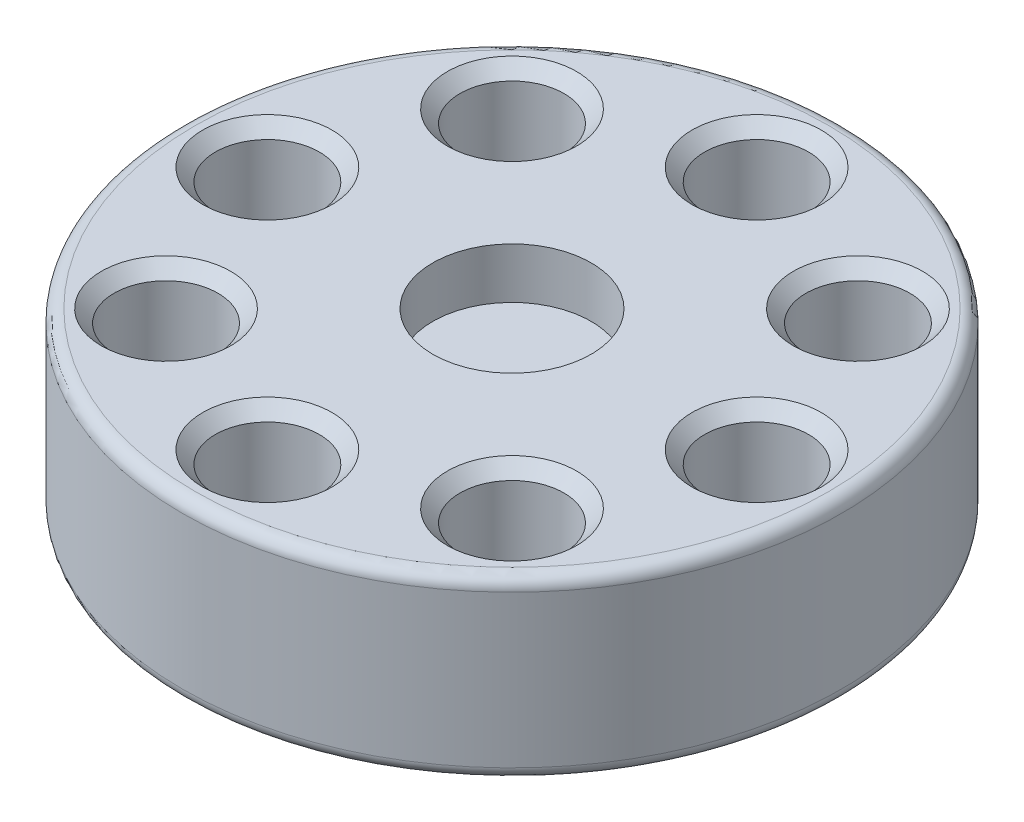
ISO-10303-21;
HEADER;
FILE_DESCRIPTION(('STEP AP214'),'2;1');
FILE_NAME('part.step','',(''),(''),'','','');
FILE_SCHEMA(('AUTOMOTIVE_DESIGN { 1 0 10303 214 1 1 1 1 }'));
ENDSEC;
DATA;
#1=APPLICATION_CONTEXT('core data for automotive mechanical design processes');
#2=APPLICATION_PROTOCOL_DEFINITION('international standard','automotive_design',2000,#1);
#3=PRODUCT_CONTEXT('',#1,'mechanical');
#4=PRODUCT('Part','Part','',(#3));
#5=PRODUCT_RELATED_PRODUCT_CATEGORY('part','',(#4));
#6=PRODUCT_DEFINITION_FORMATION('','',#4);
#7=PRODUCT_DEFINITION_CONTEXT('part definition',#1,'design');
#8=PRODUCT_DEFINITION('design','',#6,#7);
#9=PRODUCT_DEFINITION_SHAPE('','',#8);
#10=(LENGTH_UNIT() NAMED_UNIT(*) SI_UNIT(.MILLI.,.METRE.));
#11=(NAMED_UNIT(*) PLANE_ANGLE_UNIT() SI_UNIT($,.RADIAN.));
#12=(NAMED_UNIT(*) SI_UNIT($,.STERADIAN.) SOLID_ANGLE_UNIT());
#13=UNCERTAINTY_MEASURE_WITH_UNIT(LENGTH_MEASURE(1.E-05),#10,'distance_accuracy_value','');
#14=(GEOMETRIC_REPRESENTATION_CONTEXT(3) GLOBAL_UNCERTAINTY_ASSIGNED_CONTEXT((#13)) GLOBAL_UNIT_ASSIGNED_CONTEXT((#10,
#11,#12)) REPRESENTATION_CONTEXT('',''));
#15=CARTESIAN_POINT('',(0.,0.,0.));
#16=DIRECTION('',(0.,0.,1.));
#17=DIRECTION('',(1.,0.,0.));
#18=AXIS2_PLACEMENT_3D('',#15,#16,#17);
#19=CARTESIAN_POINT('',(0.,14.,0.));
#20=DIRECTION('',(0.,-1.,0.));
#21=DIRECTION('',(0.,0.,-1.));
#22=AXIS2_PLACEMENT_3D('',#19,#20,#21);
#23=CYLINDRICAL_SURFACE('',#22,26.);
#24=CARTESIAN_POINT('',(0.,0.999999999999999,0.));
#25=DIRECTION('',(0.,1.,0.));
#26=DIRECTION('',(0.,0.,1.));
#27=AXIS2_PLACEMENT_3D('',#24,#25,#26);
#28=CIRCLE('',#27,26.);
#29=CARTESIAN_POINT('',(0.,0.999999999999999,26.));
#30=VERTEX_POINT('',#29);
#31=EDGE_CURVE('E186',#30,#30,#28,.T.);
#32=ORIENTED_EDGE('',*,*,#31,.T.);
#33=EDGE_LOOP('',(#32));
#34=FACE_BOUND('',#33,.T.);
#35=CARTESIAN_POINT('',(0.,13.,0.));
#36=DIRECTION('',(0.,1.,0.));
#37=DIRECTION('',(0.,0.,1.));
#38=AXIS2_PLACEMENT_3D('',#35,#36,#37);
#39=CIRCLE('',#38,26.);
#40=CARTESIAN_POINT('',(0.,13.,26.));
#41=VERTEX_POINT('',#40);
#42=EDGE_CURVE('E190',#41,#41,#39,.F.);
#43=ORIENTED_EDGE('',*,*,#42,.T.);
#44=EDGE_LOOP('',(#43));
#45=FACE_BOUND('',#44,.T.);
#46=ADVANCED_FACE('F41',(#34,#45),#23,.T.);
#47=CARTESIAN_POINT('',(0.,14.,0.));
#48=DIRECTION('',(0.,1.,0.));
#49=DIRECTION('',(0.,0.,1.));
#50=AXIS2_PLACEMENT_3D('',#47,#48,#49);
#51=PLANE('',#50);
#52=CARTESIAN_POINT('',(13.6471608769004,14.,13.6471608769004));
#53=DIRECTION('',(0.,1.,0.));
#54=DIRECTION('',(0.,0.,1.));
#55=AXIS2_PLACEMENT_3D('',#52,#53,#54);
#56=CIRCLE('',#55,5.1);
#57=CARTESIAN_POINT('',(13.6471608769004,14.,18.7471608769004));
#58=VERTEX_POINT('',#57);
#59=EDGE_CURVE('E138',#58,#58,#56,.F.);
#60=ORIENTED_EDGE('',*,*,#59,.T.);
#61=EDGE_LOOP('',(#60));
#62=FACE_BOUND('',#61,.T.);
#63=CARTESIAN_POINT('',(0.,14.,19.3));
#64=DIRECTION('',(0.,1.,0.));
#65=DIRECTION('',(0.,0.,1.));
#66=AXIS2_PLACEMENT_3D('',#63,#64,#65);
#67=CIRCLE('',#66,5.1);
#68=CARTESIAN_POINT('',(0.,14.,24.4));
#69=VERTEX_POINT('',#68);
#70=EDGE_CURVE('E142',#69,#69,#67,.F.);
#71=ORIENTED_EDGE('',*,*,#70,.T.);
#72=EDGE_LOOP('',(#71));
#73=FACE_BOUND('',#72,.T.);
#74=CARTESIAN_POINT('',(-13.6471608769004,14.,13.6471608769004));
#75=DIRECTION('',(0.,1.,0.));
#76=DIRECTION('',(0.,0.,1.));
#77=AXIS2_PLACEMENT_3D('',#74,#75,#76);
#78=CIRCLE('',#77,5.1);
#79=CARTESIAN_POINT('',(-13.6471608769004,14.,18.7471608769004));
#80=VERTEX_POINT('',#79);
#81=EDGE_CURVE('E146',#80,#80,#78,.F.);
#82=ORIENTED_EDGE('',*,*,#81,.T.);
#83=EDGE_LOOP('',(#82));
#84=FACE_BOUND('',#83,.T.);
#85=CARTESIAN_POINT('',(0.,14.,-19.3));
#86=DIRECTION('',(0.,1.,0.));
#87=DIRECTION('',(0.,0.,1.));
#88=AXIS2_PLACEMENT_3D('',#85,#86,#87);
#89=CIRCLE('',#88,5.10000000000002);
#90=CARTESIAN_POINT('',(0.,14.,-14.2));
#91=VERTEX_POINT('',#90);
#92=EDGE_CURVE('E150',#91,#91,#89,.F.);
#93=ORIENTED_EDGE('',*,*,#92,.T.);
#94=EDGE_LOOP('',(#93));
#95=FACE_BOUND('',#94,.T.);
#96=CARTESIAN_POINT('',(-19.3,14.,0.));
#97=DIRECTION('',(0.,1.,0.));
#98=DIRECTION('',(0.,0.,1.));
#99=AXIS2_PLACEMENT_3D('',#96,#97,#98);
#100=CIRCLE('',#99,5.1);
#101=CARTESIAN_POINT('',(-19.3,14.,5.1));
#102=VERTEX_POINT('',#101);
#103=EDGE_CURVE('E154',#102,#102,#100,.F.);
#104=ORIENTED_EDGE('',*,*,#103,.T.);
#105=EDGE_LOOP('',(#104));
#106=FACE_BOUND('',#105,.T.);
#107=CARTESIAN_POINT('',(-13.6471608769,14.,-13.6471608769002));
#108=DIRECTION('',(0.,1.,0.));
#109=DIRECTION('',(0.,0.,1.));
#110=AXIS2_PLACEMENT_3D('',#107,#108,#109);
#111=CIRCLE('',#110,5.1);
#112=CARTESIAN_POINT('',(-13.6471608769,14.,-8.54716087690015));
#113=VERTEX_POINT('',#112);
#114=EDGE_CURVE('E158',#113,#113,#111,.F.);
#115=ORIENTED_EDGE('',*,*,#114,.T.);
#116=EDGE_LOOP('',(#115));
#117=FACE_BOUND('',#116,.T.);
#118=CARTESIAN_POINT('',(13.6471608769005,14.,-13.6471608769007));
#119=DIRECTION('',(0.,1.,0.));
#120=DIRECTION('',(0.,0.,1.));
#121=AXIS2_PLACEMENT_3D('',#118,#119,#120);
#122=CIRCLE('',#121,5.10000000000002);
#123=CARTESIAN_POINT('',(13.6471608769005,14.,-8.54716087690071));
#124=VERTEX_POINT('',#123);
#125=EDGE_CURVE('E162',#124,#124,#122,.F.);
#126=ORIENTED_EDGE('',*,*,#125,.T.);
#127=EDGE_LOOP('',(#126));
#128=FACE_BOUND('',#127,.T.);
#129=CARTESIAN_POINT('',(19.3,14.,0.));
#130=DIRECTION('',(0.,1.,0.));
#131=DIRECTION('',(0.,0.,1.));
#132=AXIS2_PLACEMENT_3D('',#129,#130,#131);
#133=CIRCLE('',#132,5.1);
#134=CARTESIAN_POINT('',(19.3,14.,5.1));
#135=VERTEX_POINT('',#134);
#136=EDGE_CURVE('E166',#135,#135,#133,.F.);
#137=ORIENTED_EDGE('',*,*,#136,.T.);
#138=EDGE_LOOP('',(#137));
#139=FACE_BOUND('',#138,.T.);
#140=CARTESIAN_POINT('',(0.,14.,0.));
#141=DIRECTION('',(0.,1.,0.));
#142=DIRECTION('',(0.,0.,1.));
#143=AXIS2_PLACEMENT_3D('',#140,#141,#142);
#144=CIRCLE('',#143,25.);
#145=CARTESIAN_POINT('',(0.,14.,25.));
#146=VERTEX_POINT('',#145);
#147=EDGE_CURVE('E178',#146,#146,#144,.T.);
#148=ORIENTED_EDGE('',*,*,#147,.T.);
#149=EDGE_LOOP('',(#148));
#150=FACE_BOUND('',#149,.T.);
#151=CARTESIAN_POINT('',(0.,14.,0.));
#152=DIRECTION('',(0.,1.,0.));
#153=DIRECTION('',(0.,0.,1.));
#154=AXIS2_PLACEMENT_3D('',#151,#152,#153);
#155=CIRCLE('',#154,6.25);
#156=CARTESIAN_POINT('',(0.,14.,6.25));
#157=VERTEX_POINT('',#156);
#158=EDGE_CURVE('E203',#157,#157,#155,.T.);
#159=ORIENTED_EDGE('',*,*,#158,.F.);
#160=EDGE_LOOP('',(#159));
#161=FACE_BOUND('',#160,.T.);
#162=ADVANCED_FACE('F220',(#62,#73,#84,#95,#106,#117,#128,#139,#150,#161),#51,.T.);
#163=CARTESIAN_POINT('',(0.,0.,0.));
#164=DIRECTION('',(0.,1.,0.));
#165=DIRECTION('',(0.,0.,1.));
#166=AXIS2_PLACEMENT_3D('',#163,#164,#165);
#167=PLANE('',#166);
#168=CARTESIAN_POINT('',(13.6471608769004,0.,13.6471608769004));
#169=DIRECTION('',(0.,1.,0.));
#170=DIRECTION('',(0.,0.,1.));
#171=AXIS2_PLACEMENT_3D('',#168,#169,#170);
#172=CIRCLE('',#171,5.1);
#173=CARTESIAN_POINT('',(13.6471608769004,0.,18.7471608769004));
#174=VERTEX_POINT('',#173);
#175=EDGE_CURVE('E106',#174,#174,#172,.T.);
#176=ORIENTED_EDGE('',*,*,#175,.T.);
#177=EDGE_LOOP('',(#176));
#178=FACE_BOUND('',#177,.T.);
#179=CARTESIAN_POINT('',(0.,0.,19.3));
#180=DIRECTION('',(0.,1.,0.));
#181=DIRECTION('',(0.,0.,1.));
#182=AXIS2_PLACEMENT_3D('',#179,#180,#181);
#183=CIRCLE('',#182,5.09999999999999);
#184=CARTESIAN_POINT('',(0.,0.,24.4));
#185=VERTEX_POINT('',#184);
#186=EDGE_CURVE('E110',#185,#185,#183,.T.);
#187=ORIENTED_EDGE('',*,*,#186,.T.);
#188=EDGE_LOOP('',(#187));
#189=FACE_BOUND('',#188,.T.);
#190=CARTESIAN_POINT('',(-13.6471608769004,0.,13.6471608769004));
#191=DIRECTION('',(0.,1.,0.));
#192=DIRECTION('',(0.,0.,1.));
#193=AXIS2_PLACEMENT_3D('',#190,#191,#192);
#194=CIRCLE('',#193,5.09999999999999);
#195=CARTESIAN_POINT('',(-13.6471608769004,0.,18.7471608769004));
#196=VERTEX_POINT('',#195);
#197=EDGE_CURVE('E114',#196,#196,#194,.T.);
#198=ORIENTED_EDGE('',*,*,#197,.T.);
#199=EDGE_LOOP('',(#198));
#200=FACE_BOUND('',#199,.T.);
#201=CARTESIAN_POINT('',(0.,0.,-19.3));
#202=DIRECTION('',(0.,1.,0.));
#203=DIRECTION('',(0.,0.,1.));
#204=AXIS2_PLACEMENT_3D('',#201,#202,#203);
#205=CIRCLE('',#204,5.09999999999999);
#206=CARTESIAN_POINT('',(0.,0.,-14.2));
#207=VERTEX_POINT('',#206);
#208=EDGE_CURVE('E118',#207,#207,#205,.T.);
#209=ORIENTED_EDGE('',*,*,#208,.T.);
#210=EDGE_LOOP('',(#209));
#211=FACE_BOUND('',#210,.T.);
#212=CARTESIAN_POINT('',(-19.3,0.,0.));
#213=DIRECTION('',(0.,1.,0.));
#214=DIRECTION('',(0.,0.,1.));
#215=AXIS2_PLACEMENT_3D('',#212,#213,#214);
#216=CIRCLE('',#215,5.09999999999999);
#217=CARTESIAN_POINT('',(-19.3,0.,5.09999999999999));
#218=VERTEX_POINT('',#217);
#219=EDGE_CURVE('E122',#218,#218,#216,.T.);
#220=ORIENTED_EDGE('',*,*,#219,.T.);
#221=EDGE_LOOP('',(#220));
#222=FACE_BOUND('',#221,.T.);
#223=CARTESIAN_POINT('',(-13.6471608769,0.,-13.6471608769002));
#224=DIRECTION('',(0.,1.,0.));
#225=DIRECTION('',(0.,0.,1.));
#226=AXIS2_PLACEMENT_3D('',#223,#224,#225);
#227=CIRCLE('',#226,5.09999999999999);
#228=CARTESIAN_POINT('',(-13.6471608769,0.,-8.54716087690016));
#229=VERTEX_POINT('',#228);
#230=EDGE_CURVE('E126',#229,#229,#227,.T.);
#231=ORIENTED_EDGE('',*,*,#230,.T.);
#232=EDGE_LOOP('',(#231));
#233=FACE_BOUND('',#232,.T.);
#234=CARTESIAN_POINT('',(13.6471608769005,0.,-13.6471608769007));
#235=DIRECTION('',(0.,1.,0.));
#236=DIRECTION('',(0.,0.,1.));
#237=AXIS2_PLACEMENT_3D('',#234,#235,#236);
#238=CIRCLE('',#237,5.09999999999999);
#239=CARTESIAN_POINT('',(13.6471608769005,0.,-8.54716087690074));
#240=VERTEX_POINT('',#239);
#241=EDGE_CURVE('E130',#240,#240,#238,.T.);
#242=ORIENTED_EDGE('',*,*,#241,.T.);
#243=EDGE_LOOP('',(#242));
#244=FACE_BOUND('',#243,.T.);
#245=CARTESIAN_POINT('',(19.3,0.,0.));
#246=DIRECTION('',(0.,1.,0.));
#247=DIRECTION('',(0.,0.,1.));
#248=AXIS2_PLACEMENT_3D('',#245,#246,#247);
#249=CIRCLE('',#248,5.09999999999999);
#250=CARTESIAN_POINT('',(19.3,0.,5.1));
#251=VERTEX_POINT('',#250);
#252=EDGE_CURVE('E134',#251,#251,#249,.T.);
#253=ORIENTED_EDGE('',*,*,#252,.T.);
#254=EDGE_LOOP('',(#253));
#255=FACE_BOUND('',#254,.T.);
#256=CARTESIAN_POINT('',(0.,0.,0.));
#257=DIRECTION('',(0.,1.,0.));
#258=DIRECTION('',(0.,0.,1.));
#259=AXIS2_PLACEMENT_3D('',#256,#257,#258);
#260=CIRCLE('',#259,25.);
#261=CARTESIAN_POINT('',(0.,0.,25.));
#262=VERTEX_POINT('',#261);
#263=EDGE_CURVE('E182',#262,#262,#260,.F.);
#264=ORIENTED_EDGE('',*,*,#263,.T.);
#265=EDGE_LOOP('',(#264));
#266=FACE_BOUND('',#265,.T.);
#267=CARTESIAN_POINT('',(0.,0.,0.));
#268=DIRECTION('',(0.,-1.,0.));
#269=DIRECTION('',(0.,0.,-1.));
#270=AXIS2_PLACEMENT_3D('',#267,#268,#269);
#271=CIRCLE('',#270,6.1);
#272=CARTESIAN_POINT('',(0.,0.,-6.1));
#273=VERTEX_POINT('',#272);
#274=EDGE_CURVE('E195',#273,#273,#271,.T.);
#275=ORIENTED_EDGE('',*,*,#274,.F.);
#276=EDGE_LOOP('',(#275));
#277=FACE_BOUND('',#276,.T.);
#278=ADVANCED_FACE('F222',(#178,#189,#200,#211,#222,#233,#244,#255,#266,#277),#167,.F.);
#279=CARTESIAN_POINT('',(0.,4.,0.));
#280=DIRECTION('',(0.,-1.,0.));
#281=DIRECTION('',(0.,0.,-1.));
#282=AXIS2_PLACEMENT_3D('',#279,#280,#281);
#283=CYLINDRICAL_SURFACE('',#282,6.1);
#284=CARTESIAN_POINT('',(0.,4.,0.));
#285=DIRECTION('',(0.,-1.,0.));
#286=DIRECTION('',(0.,0.,-1.));
#287=AXIS2_PLACEMENT_3D('',#284,#285,#286);
#288=CIRCLE('',#287,6.1);
#289=CARTESIAN_POINT('',(0.,4.,-6.1));
#290=VERTEX_POINT('',#289);
#291=EDGE_CURVE('E194',#290,#290,#288,.T.);
#292=ORIENTED_EDGE('',*,*,#291,.F.);
#293=EDGE_LOOP('',(#292));
#294=FACE_BOUND('',#293,.T.);
#295=ORIENTED_EDGE('',*,*,#274,.T.);
#296=EDGE_LOOP('',(#295));
#297=FACE_BOUND('',#296,.T.);
#298=ADVANCED_FACE('F229',(#294,#297),#283,.F.);
#299=CARTESIAN_POINT('',(0.,4.,0.));
#300=DIRECTION('',(0.,-1.,0.));
#301=DIRECTION('',(0.,0.,-1.));
#302=AXIS2_PLACEMENT_3D('',#299,#300,#301);
#303=PLANE('',#302);
#304=ORIENTED_EDGE('',*,*,#291,.T.);
#305=EDGE_LOOP('',(#304));
#306=FACE_BOUND('',#305,.T.);
#307=ADVANCED_FACE('F216',(#306),#303,.T.);
#308=CARTESIAN_POINT('',(0.,10.,0.));
#309=DIRECTION('',(0.,1.,0.));
#310=DIRECTION('',(0.,0.,1.));
#311=AXIS2_PLACEMENT_3D('',#308,#309,#310);
#312=CYLINDRICAL_SURFACE('',#311,6.25);
#313=CARTESIAN_POINT('',(0.,10.,0.));
#314=DIRECTION('',(0.,1.,0.));
#315=DIRECTION('',(0.,0.,1.));
#316=AXIS2_PLACEMENT_3D('',#313,#314,#315);
#317=CIRCLE('',#316,6.25);
#318=CARTESIAN_POINT('',(0.,10.,6.25));
#319=VERTEX_POINT('',#318);
#320=EDGE_CURVE('E199',#319,#319,#317,.T.);
#321=ORIENTED_EDGE('',*,*,#320,.F.);
#322=EDGE_LOOP('',(#321));
#323=FACE_BOUND('',#322,.T.);
#324=ORIENTED_EDGE('',*,*,#158,.T.);
#325=EDGE_LOOP('',(#324));
#326=FACE_BOUND('',#325,.T.);
#327=ADVANCED_FACE('F213',(#323,#326),#312,.F.);
#328=CARTESIAN_POINT('',(0.,10.,0.));
#329=DIRECTION('',(0.,1.,0.));
#330=DIRECTION('',(0.,0.,1.));
#331=AXIS2_PLACEMENT_3D('',#328,#329,#330);
#332=PLANE('',#331);
#333=ORIENTED_EDGE('',*,*,#320,.T.);
#334=EDGE_LOOP('',(#333));
#335=FACE_BOUND('',#334,.T.);
#336=ADVANCED_FACE('F211',(#335),#332,.T.);
#337=CARTESIAN_POINT('',(0.,8.,19.3));
#338=DIRECTION('',(0.,-1.,0.));
#339=DIRECTION('',(0.,0.,-1.));
#340=AXIS2_PLACEMENT_3D('',#337,#338,#339);
#341=CYLINDRICAL_SURFACE('',#340,4.1);
#342=CARTESIAN_POINT('',(0.,13.,19.3));
#343=DIRECTION('',(0.,1.,0.));
#344=DIRECTION('',(0.,0.,1.));
#345=AXIS2_PLACEMENT_3D('',#342,#343,#344);
#346=CIRCLE('',#345,4.1);
#347=CARTESIAN_POINT('',(0.,13.,23.4));
#348=VERTEX_POINT('',#347);
#349=EDGE_CURVE('E98',#348,#348,#346,.T.);
#350=ORIENTED_EDGE('',*,*,#349,.T.);
#351=EDGE_LOOP('',(#350));
#352=FACE_BOUND('',#351,.T.);
#353=CARTESIAN_POINT('',(0.,0.999999999999999,19.3));
#354=DIRECTION('',(0.,1.,0.));
#355=DIRECTION('',(0.,0.,1.));
#356=AXIS2_PLACEMENT_3D('',#353,#354,#355);
#357=CIRCLE('',#356,4.1);
#358=CARTESIAN_POINT('',(0.,0.999999999999999,23.4));
#359=VERTEX_POINT('',#358);
#360=EDGE_CURVE('E102',#359,#359,#357,.F.);
#361=ORIENTED_EDGE('',*,*,#360,.T.);
#362=EDGE_LOOP('',(#361));
#363=FACE_BOUND('',#362,.T.);
#364=ADVANCED_FACE('F377',(#352,#363),#341,.F.);
#365=CARTESIAN_POINT('',(13.6471608769004,8.,13.6471608769004));
#366=DIRECTION('',(0.,-1.,0.));
#367=DIRECTION('',(0.,0.,-1.));
#368=AXIS2_PLACEMENT_3D('',#365,#366,#367);
#369=CYLINDRICAL_SURFACE('',#368,4.1);
#370=CARTESIAN_POINT('',(13.6471608769004,13.,13.6471608769004));
#371=DIRECTION('',(0.,1.,0.));
#372=DIRECTION('',(0.,0.,1.));
#373=AXIS2_PLACEMENT_3D('',#370,#371,#372);
#374=CIRCLE('',#373,4.1);
#375=CARTESIAN_POINT('',(13.6471608769004,13.,17.7471608769004));
#376=VERTEX_POINT('',#375);
#377=EDGE_CURVE('E170',#376,#376,#374,.T.);
#378=ORIENTED_EDGE('',*,*,#377,.T.);
#379=EDGE_LOOP('',(#378));
#380=FACE_BOUND('',#379,.T.);
#381=CARTESIAN_POINT('',(13.6471608769004,0.999999999999999,13.6471608769004));
#382=DIRECTION('',(0.,1.,0.));
#383=DIRECTION('',(0.,0.,1.));
#384=AXIS2_PLACEMENT_3D('',#381,#382,#383);
#385=CIRCLE('',#384,4.1);
#386=CARTESIAN_POINT('',(13.6471608769004,0.999999999999999,17.7471608769004));
#387=VERTEX_POINT('',#386);
#388=EDGE_CURVE('E174',#387,#387,#385,.F.);
#389=ORIENTED_EDGE('',*,*,#388,.T.);
#390=EDGE_LOOP('',(#389));
#391=FACE_BOUND('',#390,.T.);
#392=ADVANCED_FACE('F380',(#380,#391),#369,.F.);
#393=CARTESIAN_POINT('',(19.3,8.,0.));
#394=DIRECTION('',(0.,-1.,0.));
#395=DIRECTION('',(0.,0.,-1.));
#396=AXIS2_PLACEMENT_3D('',#393,#394,#395);
#397=CYLINDRICAL_SURFACE('',#396,4.1);
#398=CARTESIAN_POINT('',(19.3,13.,0.));
#399=DIRECTION('',(0.,1.,0.));
#400=DIRECTION('',(0.,0.,1.));
#401=AXIS2_PLACEMENT_3D('',#398,#399,#400);
#402=CIRCLE('',#401,4.1);
#403=CARTESIAN_POINT('',(19.3,13.,4.1));
#404=VERTEX_POINT('',#403);
#405=EDGE_CURVE('E10',#404,#404,#402,.T.);
#406=ORIENTED_EDGE('',*,*,#405,.T.);
#407=EDGE_LOOP('',(#406));
#408=FACE_BOUND('',#407,.T.);
#409=CARTESIAN_POINT('',(19.3,0.999999999999999,0.));
#410=DIRECTION('',(0.,1.,0.));
#411=DIRECTION('',(0.,0.,1.));
#412=AXIS2_PLACEMENT_3D('',#409,#410,#411);
#413=CIRCLE('',#412,4.1);
#414=CARTESIAN_POINT('',(19.3,0.999999999999999,4.1));
#415=VERTEX_POINT('',#414);
#416=EDGE_CURVE('E50',#415,#415,#413,.F.);
#417=ORIENTED_EDGE('',*,*,#416,.T.);
#418=EDGE_LOOP('',(#417));
#419=FACE_BOUND('',#418,.T.);
#420=ADVANCED_FACE('F400',(#408,#419),#397,.F.);
#421=CARTESIAN_POINT('',(13.6471608769005,8.,-13.6471608769007));
#422=DIRECTION('',(0.,-1.,0.));
#423=DIRECTION('',(0.,0.,-1.));
#424=AXIS2_PLACEMENT_3D('',#421,#422,#423);
#425=CYLINDRICAL_SURFACE('',#424,4.1);
#426=CARTESIAN_POINT('',(13.6471608769005,13.,-13.6471608769007));
#427=DIRECTION('',(0.,1.,0.));
#428=DIRECTION('',(0.,0.,1.));
#429=AXIS2_PLACEMENT_3D('',#426,#427,#428);
#430=CIRCLE('',#429,4.1);
#431=CARTESIAN_POINT('',(13.6471608769005,13.,-9.54716087690073));
#432=VERTEX_POINT('',#431);
#433=EDGE_CURVE('E55',#432,#432,#430,.T.);
#434=ORIENTED_EDGE('',*,*,#433,.T.);
#435=EDGE_LOOP('',(#434));
#436=FACE_BOUND('',#435,.T.);
#437=CARTESIAN_POINT('',(13.6471608769005,0.999999999999999,-13.6471608769007));
#438=DIRECTION('',(0.,1.,0.));
#439=DIRECTION('',(0.,0.,1.));
#440=AXIS2_PLACEMENT_3D('',#437,#438,#439);
#441=CIRCLE('',#440,4.1);
#442=CARTESIAN_POINT('',(13.6471608769005,0.999999999999999,-9.54716087690073));
#443=VERTEX_POINT('',#442);
#444=EDGE_CURVE('E60',#443,#443,#441,.F.);
#445=ORIENTED_EDGE('',*,*,#444,.T.);
#446=EDGE_LOOP('',(#445));
#447=FACE_BOUND('',#446,.T.);
#448=ADVANCED_FACE('F396',(#436,#447),#425,.F.);
#449=CARTESIAN_POINT('',(0.,8.,-19.3));
#450=DIRECTION('',(0.,-1.,0.));
#451=DIRECTION('',(0.,0.,-1.));
#452=AXIS2_PLACEMENT_3D('',#449,#450,#451);
#453=CYLINDRICAL_SURFACE('',#452,4.1);
#454=CARTESIAN_POINT('',(0.,13.,-19.3));
#455=DIRECTION('',(0.,1.,0.));
#456=DIRECTION('',(0.,0.,1.));
#457=AXIS2_PLACEMENT_3D('',#454,#455,#456);
#458=CIRCLE('',#457,4.1);
#459=CARTESIAN_POINT('',(0.,13.,-15.2));
#460=VERTEX_POINT('',#459);
#461=EDGE_CURVE('E82',#460,#460,#458,.T.);
#462=ORIENTED_EDGE('',*,*,#461,.T.);
#463=EDGE_LOOP('',(#462));
#464=FACE_BOUND('',#463,.T.);
#465=CARTESIAN_POINT('',(0.,0.999999999999999,-19.3));
#466=DIRECTION('',(0.,1.,0.));
#467=DIRECTION('',(0.,0.,1.));
#468=AXIS2_PLACEMENT_3D('',#465,#466,#467);
#469=CIRCLE('',#468,4.1);
#470=CARTESIAN_POINT('',(0.,0.999999999999999,-15.2));
#471=VERTEX_POINT('',#470);
#472=EDGE_CURVE('E86',#471,#471,#469,.F.);
#473=ORIENTED_EDGE('',*,*,#472,.T.);
#474=EDGE_LOOP('',(#473));
#475=FACE_BOUND('',#474,.T.);
#476=ADVANCED_FACE('F392',(#464,#475),#453,.F.);
#477=CARTESIAN_POINT('',(-13.6471608769,8.,-13.6471608769002));
#478=DIRECTION('',(0.,-1.,0.));
#479=DIRECTION('',(0.,0.,-1.));
#480=AXIS2_PLACEMENT_3D('',#477,#478,#479);
#481=CYLINDRICAL_SURFACE('',#480,4.1);
#482=CARTESIAN_POINT('',(-13.6471608769,13.,-13.6471608769002));
#483=DIRECTION('',(0.,1.,0.));
#484=DIRECTION('',(0.,0.,1.));
#485=AXIS2_PLACEMENT_3D('',#482,#483,#484);
#486=CIRCLE('',#485,4.1);
#487=CARTESIAN_POINT('',(-13.6471608769,13.,-9.54716087690015));
#488=VERTEX_POINT('',#487);
#489=EDGE_CURVE('E66',#488,#488,#486,.T.);
#490=ORIENTED_EDGE('',*,*,#489,.T.);
#491=EDGE_LOOP('',(#490));
#492=FACE_BOUND('',#491,.T.);
#493=CARTESIAN_POINT('',(-13.6471608769,0.999999999999999,-13.6471608769002));
#494=DIRECTION('',(0.,1.,0.));
#495=DIRECTION('',(0.,0.,1.));
#496=AXIS2_PLACEMENT_3D('',#493,#494,#495);
#497=CIRCLE('',#496,4.1);
#498=CARTESIAN_POINT('',(-13.6471608769,0.999999999999999,-9.54716087690015));
#499=VERTEX_POINT('',#498);
#500=EDGE_CURVE('E70',#499,#499,#497,.F.);
#501=ORIENTED_EDGE('',*,*,#500,.T.);
#502=EDGE_LOOP('',(#501));
#503=FACE_BOUND('',#502,.T.);
#504=ADVANCED_FACE('F388',(#492,#503),#481,.F.);
#505=CARTESIAN_POINT('',(-19.3,8.,0.));
#506=DIRECTION('',(0.,-1.,0.));
#507=DIRECTION('',(0.,0.,-1.));
#508=AXIS2_PLACEMENT_3D('',#505,#506,#507);
#509=CYLINDRICAL_SURFACE('',#508,4.1);
#510=CARTESIAN_POINT('',(-19.3,13.,0.));
#511=DIRECTION('',(0.,1.,0.));
#512=DIRECTION('',(0.,0.,1.));
#513=AXIS2_PLACEMENT_3D('',#510,#511,#512);
#514=CIRCLE('',#513,4.1);
#515=CARTESIAN_POINT('',(-19.3,13.,4.1));
#516=VERTEX_POINT('',#515);
#517=EDGE_CURVE('E74',#516,#516,#514,.T.);
#518=ORIENTED_EDGE('',*,*,#517,.T.);
#519=EDGE_LOOP('',(#518));
#520=FACE_BOUND('',#519,.T.);
#521=CARTESIAN_POINT('',(-19.3,0.999999999999999,0.));
#522=DIRECTION('',(0.,1.,0.));
#523=DIRECTION('',(0.,0.,1.));
#524=AXIS2_PLACEMENT_3D('',#521,#522,#523);
#525=CIRCLE('',#524,4.1);
#526=CARTESIAN_POINT('',(-19.3,0.999999999999999,4.1));
#527=VERTEX_POINT('',#526);
#528=EDGE_CURVE('E78',#527,#527,#525,.F.);
#529=ORIENTED_EDGE('',*,*,#528,.T.);
#530=EDGE_LOOP('',(#529));
#531=FACE_BOUND('',#530,.T.);
#532=ADVANCED_FACE('F384',(#520,#531),#509,.F.);
#533=CARTESIAN_POINT('',(-13.6471608769004,8.,13.6471608769004));
#534=DIRECTION('',(0.,-1.,0.));
#535=DIRECTION('',(0.,0.,-1.));
#536=AXIS2_PLACEMENT_3D('',#533,#534,#535);
#537=CYLINDRICAL_SURFACE('',#536,4.1);
#538=CARTESIAN_POINT('',(-13.6471608769004,13.,13.6471608769004));
#539=DIRECTION('',(0.,1.,0.));
#540=DIRECTION('',(0.,0.,1.));
#541=AXIS2_PLACEMENT_3D('',#538,#539,#540);
#542=CIRCLE('',#541,4.1);
#543=CARTESIAN_POINT('',(-13.6471608769004,13.,17.7471608769004));
#544=VERTEX_POINT('',#543);
#545=EDGE_CURVE('E90',#544,#544,#542,.T.);
#546=ORIENTED_EDGE('',*,*,#545,.T.);
#547=EDGE_LOOP('',(#546));
#548=FACE_BOUND('',#547,.T.);
#549=CARTESIAN_POINT('',(-13.6471608769004,0.999999999999999,13.6471608769004));
#550=DIRECTION('',(0.,1.,0.));
#551=DIRECTION('',(0.,0.,1.));
#552=AXIS2_PLACEMENT_3D('',#549,#550,#551);
#553=CIRCLE('',#552,4.1);
#554=CARTESIAN_POINT('',(-13.6471608769004,0.999999999999999,17.7471608769004));
#555=VERTEX_POINT('',#554);
#556=EDGE_CURVE('E94',#555,#555,#553,.F.);
#557=ORIENTED_EDGE('',*,*,#556,.T.);
#558=EDGE_LOOP('',(#557));
#559=FACE_BOUND('',#558,.T.);
#560=ADVANCED_FACE('F242',(#548,#559),#537,.F.);
#561=CARTESIAN_POINT('',(0.,0.999999999999999,0.));
#562=DIRECTION('',(0.,1.,0.));
#563=DIRECTION('',(0.,0.,1.));
#564=AXIS2_PLACEMENT_3D('',#561,#562,#563);
#565=TOROIDAL_SURFACE('',#564,25.,1.);
#566=ORIENTED_EDGE('',*,*,#263,.F.);
#567=EDGE_LOOP('',(#566));
#568=FACE_BOUND('',#567,.T.);
#569=ORIENTED_EDGE('',*,*,#31,.F.);
#570=EDGE_LOOP('',(#569));
#571=FACE_BOUND('',#570,.T.);
#572=ADVANCED_FACE('F238',(#568,#571),#565,.T.);
#573=CARTESIAN_POINT('',(0.,13.,0.));
#574=DIRECTION('',(0.,1.,0.));
#575=DIRECTION('',(0.,0.,1.));
#576=AXIS2_PLACEMENT_3D('',#573,#574,#575);
#577=TOROIDAL_SURFACE('',#576,25.,1.);
#578=ORIENTED_EDGE('',*,*,#42,.F.);
#579=EDGE_LOOP('',(#578));
#580=FACE_BOUND('',#579,.T.);
#581=ORIENTED_EDGE('',*,*,#147,.F.);
#582=EDGE_LOOP('',(#581));
#583=FACE_BOUND('',#582,.T.);
#584=ADVANCED_FACE('F241',(#580,#583),#577,.T.);
#585=CARTESIAN_POINT('',(13.6471608769004,13.,13.6471608769004));
#586=DIRECTION('',(0.,1.,0.));
#587=DIRECTION('',(0.,0.,1.));
#588=AXIS2_PLACEMENT_3D('',#585,#586,#587);
#589=CONICAL_SURFACE('',#588,4.1,0.785398163397452);
#590=ORIENTED_EDGE('',*,*,#59,.F.);
#591=EDGE_LOOP('',(#590));
#592=FACE_BOUND('',#591,.T.);
#593=ORIENTED_EDGE('',*,*,#377,.F.);
#594=EDGE_LOOP('',(#593));
#595=FACE_BOUND('',#594,.T.);
#596=ADVANCED_FACE('F246',(#592,#595),#589,.F.);
#597=CARTESIAN_POINT('',(13.6471608769004,0.,13.6471608769004));
#598=DIRECTION('',(0.,-1.,0.));
#599=DIRECTION('',(0.,0.,-1.));
#600=AXIS2_PLACEMENT_3D('',#597,#598,#599);
#601=CONICAL_SURFACE('',#600,5.1,0.785398163397446);
#602=ORIENTED_EDGE('',*,*,#388,.F.);
#603=EDGE_LOOP('',(#602));
#604=FACE_BOUND('',#603,.T.);
#605=ORIENTED_EDGE('',*,*,#175,.F.);
#606=EDGE_LOOP('',(#605));
#607=FACE_BOUND('',#606,.T.);
#608=ADVANCED_FACE('F254',(#604,#607),#601,.F.);
#609=CARTESIAN_POINT('',(0.,13.,19.3));
#610=DIRECTION('',(0.,1.,0.));
#611=DIRECTION('',(0.,0.,1.));
#612=AXIS2_PLACEMENT_3D('',#609,#610,#611);
#613=CONICAL_SURFACE('',#612,4.1,0.785398163397451);
#614=ORIENTED_EDGE('',*,*,#70,.F.);
#615=EDGE_LOOP('',(#614));
#616=FACE_BOUND('',#615,.T.);
#617=ORIENTED_EDGE('',*,*,#349,.F.);
#618=EDGE_LOOP('',(#617));
#619=FACE_BOUND('',#618,.T.);
#620=ADVANCED_FACE('F261',(#616,#619),#613,.F.);
#621=CARTESIAN_POINT('',(0.,0.,19.3));
#622=DIRECTION('',(0.,-1.,0.));
#623=DIRECTION('',(0.,0.,-1.));
#624=AXIS2_PLACEMENT_3D('',#621,#622,#623);
#625=CONICAL_SURFACE('',#624,5.09999999999999,0.785398163397445);
#626=ORIENTED_EDGE('',*,*,#360,.F.);
#627=EDGE_LOOP('',(#626));
#628=FACE_BOUND('',#627,.T.);
#629=ORIENTED_EDGE('',*,*,#186,.F.);
#630=EDGE_LOOP('',(#629));
#631=FACE_BOUND('',#630,.T.);
#632=ADVANCED_FACE('F268',(#628,#631),#625,.F.);
#633=CARTESIAN_POINT('',(-13.6471608769004,13.,13.6471608769004));
#634=DIRECTION('',(0.,1.,0.));
#635=DIRECTION('',(0.,0.,1.));
#636=AXIS2_PLACEMENT_3D('',#633,#634,#635);
#637=CONICAL_SURFACE('',#636,4.1,0.785398163397451);
#638=ORIENTED_EDGE('',*,*,#81,.F.);
#639=EDGE_LOOP('',(#638));
#640=FACE_BOUND('',#639,.T.);
#641=ORIENTED_EDGE('',*,*,#545,.F.);
#642=EDGE_LOOP('',(#641));
#643=FACE_BOUND('',#642,.T.);
#644=ADVANCED_FACE('F275',(#640,#643),#637,.F.);
#645=CARTESIAN_POINT('',(-13.6471608769004,0.,13.6471608769004));
#646=DIRECTION('',(0.,-1.,0.));
#647=DIRECTION('',(0.,0.,-1.));
#648=AXIS2_PLACEMENT_3D('',#645,#646,#647);
#649=CONICAL_SURFACE('',#648,5.09999999999999,0.785398163397445);
#650=ORIENTED_EDGE('',*,*,#556,.F.);
#651=EDGE_LOOP('',(#650));
#652=FACE_BOUND('',#651,.T.);
#653=ORIENTED_EDGE('',*,*,#197,.F.);
#654=EDGE_LOOP('',(#653));
#655=FACE_BOUND('',#654,.T.);
#656=ADVANCED_FACE('F282',(#652,#655),#649,.F.);
#657=CARTESIAN_POINT('',(0.,13.,-19.3));
#658=DIRECTION('',(0.,1.,0.));
#659=DIRECTION('',(0.,0.,1.));
#660=AXIS2_PLACEMENT_3D('',#657,#658,#659);
#661=CONICAL_SURFACE('',#660,4.1,0.785398163397451);
#662=ORIENTED_EDGE('',*,*,#92,.F.);
#663=EDGE_LOOP('',(#662));
#664=FACE_BOUND('',#663,.T.);
#665=ORIENTED_EDGE('',*,*,#461,.F.);
#666=EDGE_LOOP('',(#665));
#667=FACE_BOUND('',#666,.T.);
#668=ADVANCED_FACE('F289',(#664,#667),#661,.F.);
#669=CARTESIAN_POINT('',(0.,0.,-19.3));
#670=DIRECTION('',(0.,-1.,0.));
#671=DIRECTION('',(0.,0.,-1.));
#672=AXIS2_PLACEMENT_3D('',#669,#670,#671);
#673=CONICAL_SURFACE('',#672,5.09999999999999,0.785398163397445);
#674=ORIENTED_EDGE('',*,*,#472,.F.);
#675=EDGE_LOOP('',(#674));
#676=FACE_BOUND('',#675,.T.);
#677=ORIENTED_EDGE('',*,*,#208,.F.);
#678=EDGE_LOOP('',(#677));
#679=FACE_BOUND('',#678,.T.);
#680=ADVANCED_FACE('F296',(#676,#679),#673,.F.);
#681=CARTESIAN_POINT('',(-19.3,13.,0.));
#682=DIRECTION('',(0.,1.,0.));
#683=DIRECTION('',(0.,0.,1.));
#684=AXIS2_PLACEMENT_3D('',#681,#682,#683);
#685=CONICAL_SURFACE('',#684,4.1,0.785398163397451);
#686=ORIENTED_EDGE('',*,*,#103,.F.);
#687=EDGE_LOOP('',(#686));
#688=FACE_BOUND('',#687,.T.);
#689=ORIENTED_EDGE('',*,*,#517,.F.);
#690=EDGE_LOOP('',(#689));
#691=FACE_BOUND('',#690,.T.);
#692=ADVANCED_FACE('F303',(#688,#691),#685,.F.);
#693=CARTESIAN_POINT('',(-13.6471608769,13.,-13.6471608769002));
#694=DIRECTION('',(0.,1.,0.));
#695=DIRECTION('',(0.,0.,1.));
#696=AXIS2_PLACEMENT_3D('',#693,#694,#695);
#697=CONICAL_SURFACE('',#696,4.1,0.785398163397451);
#698=ORIENTED_EDGE('',*,*,#114,.F.);
#699=EDGE_LOOP('',(#698));
#700=FACE_BOUND('',#699,.T.);
#701=ORIENTED_EDGE('',*,*,#489,.F.);
#702=EDGE_LOOP('',(#701));
#703=FACE_BOUND('',#702,.T.);
#704=ADVANCED_FACE('F310',(#700,#703),#697,.F.);
#705=CARTESIAN_POINT('',(13.6471608769005,13.,-13.6471608769007));
#706=DIRECTION('',(0.,1.,0.));
#707=DIRECTION('',(0.,0.,1.));
#708=AXIS2_PLACEMENT_3D('',#705,#706,#707);
#709=CONICAL_SURFACE('',#708,4.1,0.785398163397451);
#710=ORIENTED_EDGE('',*,*,#125,.F.);
#711=EDGE_LOOP('',(#710));
#712=FACE_BOUND('',#711,.T.);
#713=ORIENTED_EDGE('',*,*,#433,.F.);
#714=EDGE_LOOP('',(#713));
#715=FACE_BOUND('',#714,.T.);
#716=ADVANCED_FACE('F317',(#712,#715),#709,.F.);
#717=CARTESIAN_POINT('',(19.3,13.,0.));
#718=DIRECTION('',(0.,1.,0.));
#719=DIRECTION('',(0.,0.,1.));
#720=AXIS2_PLACEMENT_3D('',#717,#718,#719);
#721=CONICAL_SURFACE('',#720,4.1,0.785398163397451);
#722=ORIENTED_EDGE('',*,*,#136,.F.);
#723=EDGE_LOOP('',(#722));
#724=FACE_BOUND('',#723,.T.);
#725=ORIENTED_EDGE('',*,*,#405,.F.);
#726=EDGE_LOOP('',(#725));
#727=FACE_BOUND('',#726,.T.);
#728=ADVANCED_FACE('F324',(#724,#727),#721,.F.);
#729=CARTESIAN_POINT('',(-19.3,0.,0.));
#730=DIRECTION('',(0.,-1.,0.));
#731=DIRECTION('',(0.,0.,-1.));
#732=AXIS2_PLACEMENT_3D('',#729,#730,#731);
#733=CONICAL_SURFACE('',#732,5.09999999999999,0.785398163397445);
#734=ORIENTED_EDGE('',*,*,#528,.F.);
#735=EDGE_LOOP('',(#734));
#736=FACE_BOUND('',#735,.T.);
#737=ORIENTED_EDGE('',*,*,#219,.F.);
#738=EDGE_LOOP('',(#737));
#739=FACE_BOUND('',#738,.T.);
#740=ADVANCED_FACE('F331',(#736,#739),#733,.F.);
#741=CARTESIAN_POINT('',(-13.6471608769,0.,-13.6471608769002));
#742=DIRECTION('',(0.,-1.,0.));
#743=DIRECTION('',(0.,0.,-1.));
#744=AXIS2_PLACEMENT_3D('',#741,#742,#743);
#745=CONICAL_SURFACE('',#744,5.09999999999999,0.785398163397445);
#746=ORIENTED_EDGE('',*,*,#500,.F.);
#747=EDGE_LOOP('',(#746));
#748=FACE_BOUND('',#747,.T.);
#749=ORIENTED_EDGE('',*,*,#230,.F.);
#750=EDGE_LOOP('',(#749));
#751=FACE_BOUND('',#750,.T.);
#752=ADVANCED_FACE('F338',(#748,#751),#745,.F.);
#753=CARTESIAN_POINT('',(13.6471608769005,0.,-13.6471608769007));
#754=DIRECTION('',(0.,-1.,0.));
#755=DIRECTION('',(0.,0.,-1.));
#756=AXIS2_PLACEMENT_3D('',#753,#754,#755);
#757=CONICAL_SURFACE('',#756,5.09999999999999,0.785398163397445);
#758=ORIENTED_EDGE('',*,*,#444,.F.);
#759=EDGE_LOOP('',(#758));
#760=FACE_BOUND('',#759,.T.);
#761=ORIENTED_EDGE('',*,*,#241,.F.);
#762=EDGE_LOOP('',(#761));
#763=FACE_BOUND('',#762,.T.);
#764=ADVANCED_FACE('F344',(#760,#763),#757,.F.);
#765=CARTESIAN_POINT('',(19.3,0.,0.));
#766=DIRECTION('',(0.,-1.,0.));
#767=DIRECTION('',(0.,0.,-1.));
#768=AXIS2_PLACEMENT_3D('',#765,#766,#767);
#769=CONICAL_SURFACE('',#768,5.09999999999999,0.785398163397445);
#770=ORIENTED_EDGE('',*,*,#416,.F.);
#771=EDGE_LOOP('',(#770));
#772=FACE_BOUND('',#771,.T.);
#773=ORIENTED_EDGE('',*,*,#252,.F.);
#774=EDGE_LOOP('',(#773));
#775=FACE_BOUND('',#774,.T.);
#776=ADVANCED_FACE('F44',(#772,#775),#769,.F.);
#777=CLOSED_SHELL('',(#46,#162,#278,#298,#307,#327,#336,#364,#392,#420,#448,#476,#504,#532,#560,
#572,#584,#596,#608,#620,#632,#644,#656,#668,#680,#692,#704,#716,#728,#740,#752,#764,#776));
#778=MANIFOLD_SOLID_BREP('B2',#777);
#779=ADVANCED_BREP_SHAPE_REPRESENTATION('',(#18,#778),#14);
#780=SHAPE_DEFINITION_REPRESENTATION(#9,#779);
ENDSEC;
END-ISO-10303-21;
